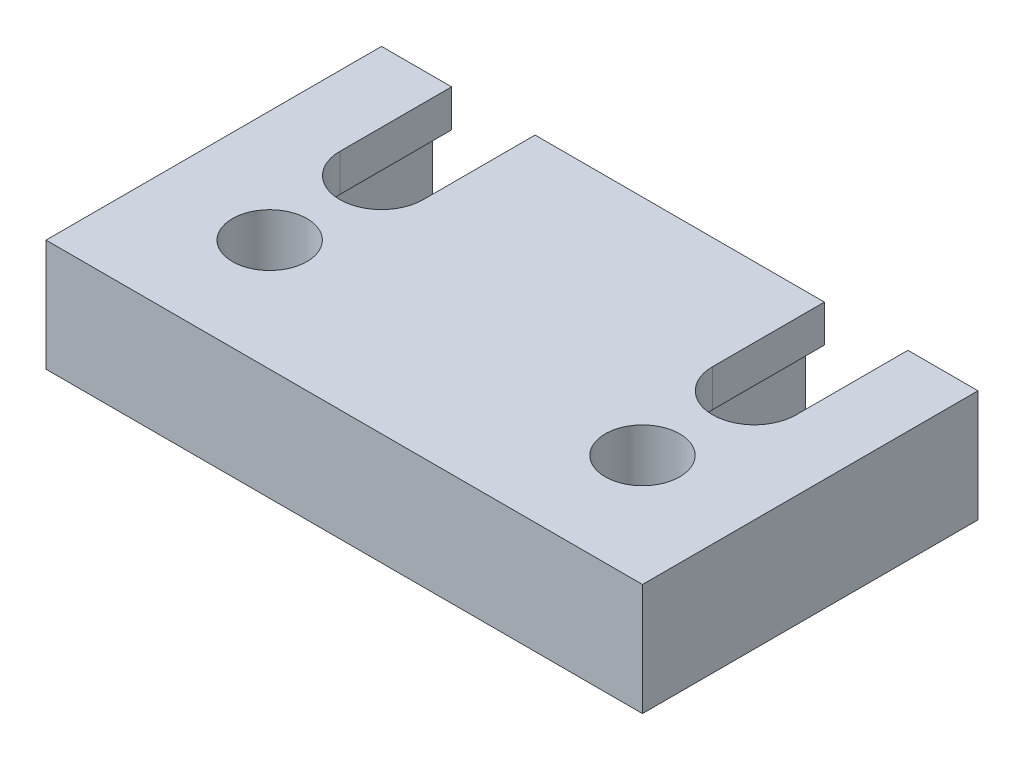
ISO-10303-21;
HEADER;
FILE_DESCRIPTION(('STEP AP214'),'2;1');
FILE_NAME('part.step','',(''),(''),'','','');
FILE_SCHEMA(('AUTOMOTIVE_DESIGN { 1 0 10303 214 1 1 1 1 }'));
ENDSEC;
DATA;
#1=APPLICATION_CONTEXT('core data for automotive mechanical design processes');
#2=APPLICATION_PROTOCOL_DEFINITION('international standard','automotive_design',2000,#1);
#3=PRODUCT_CONTEXT('',#1,'mechanical');
#4=PRODUCT('Part','Part','',(#3));
#5=PRODUCT_RELATED_PRODUCT_CATEGORY('part','',(#4));
#6=PRODUCT_DEFINITION_FORMATION('','',#4);
#7=PRODUCT_DEFINITION_CONTEXT('part definition',#1,'design');
#8=PRODUCT_DEFINITION('design','',#6,#7);
#9=PRODUCT_DEFINITION_SHAPE('','',#8);
#10=(LENGTH_UNIT() NAMED_UNIT(*) SI_UNIT(.MILLI.,.METRE.));
#11=(NAMED_UNIT(*) PLANE_ANGLE_UNIT() SI_UNIT($,.RADIAN.));
#12=(NAMED_UNIT(*) SI_UNIT($,.STERADIAN.) SOLID_ANGLE_UNIT());
#13=UNCERTAINTY_MEASURE_WITH_UNIT(LENGTH_MEASURE(1.E-05),#10,'distance_accuracy_value','');
#14=(GEOMETRIC_REPRESENTATION_CONTEXT(3) GLOBAL_UNCERTAINTY_ASSIGNED_CONTEXT((#13)) GLOBAL_UNIT_ASSIGNED_CONTEXT((#10,
#11,#12)) REPRESENTATION_CONTEXT('',''));
#15=CARTESIAN_POINT('',(0.,0.,0.));
#16=DIRECTION('',(0.,0.,1.));
#17=DIRECTION('',(1.,0.,0.));
#18=AXIS2_PLACEMENT_3D('',#15,#16,#17);
#19=CARTESIAN_POINT('',(0.,19.05,0.));
#20=DIRECTION('',(0.,-1.,0.));
#21=DIRECTION('',(0.,0.,-1.));
#22=AXIS2_PLACEMENT_3D('',#19,#20,#21);
#23=PLANE('',#22);
#24=CARTESIAN_POINT('',(88.9,19.05,-19.05));
#25=DIRECTION('',(0.,1.,0.));
#26=DIRECTION('',(0.,0.,1.));
#27=AXIS2_PLACEMENT_3D('',#24,#25,#26);
#28=CIRCLE('',#27,6.34999999999999);
#29=CARTESIAN_POINT('',(88.9,19.05,-12.7));
#30=VERTEX_POINT('',#29);
#31=EDGE_CURVE('E278',#30,#30,#28,.T.);
#32=ORIENTED_EDGE('',*,*,#31,.F.);
#33=EDGE_LOOP('',(#32));
#34=FACE_BOUND('',#33,.T.);
#35=CARTESIAN_POINT('',(25.4,19.05,-19.05));
#36=DIRECTION('',(0.,1.,0.));
#37=DIRECTION('',(0.,0.,1.));
#38=AXIS2_PLACEMENT_3D('',#35,#36,#37);
#39=CIRCLE('',#38,6.34999999999999);
#40=CARTESIAN_POINT('',(25.4,19.05,-12.7));
#41=VERTEX_POINT('',#40);
#42=EDGE_CURVE('E272',#41,#41,#39,.T.);
#43=ORIENTED_EDGE('',*,*,#42,.F.);
#44=EDGE_LOOP('',(#43));
#45=FACE_BOUND('',#44,.T.);
#46=DIRECTION('',(1.,0.,0.));
#47=VECTOR('',#46,1.);
#48=CARTESIAN_POINT('',(0.,19.05,-57.15));
#49=LINE('',#48,#47);
#50=CARTESIAN_POINT('',(6.34999999999999,19.05,-57.15));
#51=VERTEX_POINT('',#50);
#52=CARTESIAN_POINT('',(18.288,19.05,-57.15));
#53=VERTEX_POINT('',#52);
#54=EDGE_CURVE('E333',#51,#53,#49,.T.);
#55=ORIENTED_EDGE('',*,*,#54,.F.);
#56=DIRECTION('',(0.,0.,-1.));
#57=VECTOR('',#56,1.);
#58=CARTESIAN_POINT('',(6.35,19.05,0.));
#59=LINE('',#58,#57);
#60=CARTESIAN_POINT('',(6.35,19.05,0.));
#61=VERTEX_POINT('',#60);
#62=EDGE_CURVE('E211',#61,#51,#59,.T.);
#63=ORIENTED_EDGE('',*,*,#62,.F.);
#64=DIRECTION('',(1.,0.,0.));
#65=VECTOR('',#64,1.);
#66=CARTESIAN_POINT('',(0.,19.05,0.));
#67=LINE('',#66,#65);
#68=CARTESIAN_POINT('',(107.95,19.05,0.));
#69=VERTEX_POINT('',#68);
#70=EDGE_CURVE('E310',#61,#69,#67,.T.);
#71=ORIENTED_EDGE('',*,*,#70,.T.);
#72=DIRECTION('',(0.,0.,1.));
#73=VECTOR('',#72,1.);
#74=CARTESIAN_POINT('',(107.95,19.05,0.));
#75=LINE('',#74,#73);
#76=CARTESIAN_POINT('',(107.95,19.05,-57.15));
#77=VERTEX_POINT('',#76);
#78=EDGE_CURVE('E206',#77,#69,#75,.T.);
#79=ORIENTED_EDGE('',*,*,#78,.F.);
#80=CARTESIAN_POINT('',(96.012,19.05,-57.15));
#81=VERTEX_POINT('',#80);
#82=EDGE_CURVE('E68',#81,#77,#49,.T.);
#83=ORIENTED_EDGE('',*,*,#82,.F.);
#84=DIRECTION('',(0.,0.,-1.));
#85=VECTOR('',#84,1.);
#86=CARTESIAN_POINT('',(96.012,19.05,-63.5));
#87=LINE('',#86,#85);
#88=CARTESIAN_POINT('',(96.012,19.05,-38.1));
#89=VERTEX_POINT('',#88);
#90=EDGE_CURVE('E300',#89,#81,#87,.T.);
#91=ORIENTED_EDGE('',*,*,#90,.F.);
#92=CARTESIAN_POINT('',(88.9,19.05,-38.1));
#93=DIRECTION('',(0.,1.,0.));
#94=DIRECTION('',(0.,0.,-1.));
#95=AXIS2_PLACEMENT_3D('',#92,#93,#94);
#96=CIRCLE('',#95,7.11200000000001);
#97=CARTESIAN_POINT('',(81.788,19.05,-38.1));
#98=VERTEX_POINT('',#97);
#99=EDGE_CURVE('E297',#98,#89,#96,.T.);
#100=ORIENTED_EDGE('',*,*,#99,.F.);
#101=DIRECTION('',(0.,0.,1.));
#102=VECTOR('',#101,1.);
#103=CARTESIAN_POINT('',(81.788,19.05,-63.5));
#104=LINE('',#103,#102);
#105=CARTESIAN_POINT('',(81.788,19.05,-57.15));
#106=VERTEX_POINT('',#105);
#107=EDGE_CURVE('E295',#106,#98,#104,.T.);
#108=ORIENTED_EDGE('',*,*,#107,.F.);
#109=CARTESIAN_POINT('',(32.512,19.05,-57.15));
#110=VERTEX_POINT('',#109);
#111=EDGE_CURVE('E334',#110,#106,#49,.T.);
#112=ORIENTED_EDGE('',*,*,#111,.F.);
#113=DIRECTION('',(0.,0.,-1.));
#114=VECTOR('',#113,1.);
#115=CARTESIAN_POINT('',(32.512,19.05,-63.5));
#116=LINE('',#115,#114);
#117=CARTESIAN_POINT('',(32.512,19.05,-38.1));
#118=VERTEX_POINT('',#117);
#119=EDGE_CURVE('E286',#118,#110,#116,.T.);
#120=ORIENTED_EDGE('',*,*,#119,.F.);
#121=CARTESIAN_POINT('',(25.4,19.05,-38.1));
#122=DIRECTION('',(0.,1.,0.));
#123=DIRECTION('',(0.,0.,1.));
#124=AXIS2_PLACEMENT_3D('',#121,#122,#123);
#125=CIRCLE('',#124,7.11200000000002);
#126=CARTESIAN_POINT('',(18.288,19.05,-38.1));
#127=VERTEX_POINT('',#126);
#128=EDGE_CURVE('E283',#127,#118,#125,.T.);
#129=ORIENTED_EDGE('',*,*,#128,.F.);
#130=DIRECTION('',(0.,0.,1.));
#131=VECTOR('',#130,1.);
#132=CARTESIAN_POINT('',(18.288,19.05,-63.5));
#133=LINE('',#132,#131);
#134=EDGE_CURVE('E281',#53,#127,#133,.T.);
#135=ORIENTED_EDGE('',*,*,#134,.F.);
#136=EDGE_LOOP('',(#55,#63,#71,#79,#83,#91,#100,#108,#112,#120,#129,#135));
#137=FACE_BOUND('',#136,.T.);
#138=ADVANCED_FACE('F45',(#34,#45,#137),#23,.F.);
#139=CARTESIAN_POINT('',(0.,0.,0.));
#140=DIRECTION('',(0.,-1.,0.));
#141=DIRECTION('',(0.,0.,-1.));
#142=AXIS2_PLACEMENT_3D('',#139,#140,#141);
#143=PLANE('',#142);
#144=CARTESIAN_POINT('',(88.9,0.,-19.05));
#145=DIRECTION('',(0.,1.,0.));
#146=DIRECTION('',(0.,0.,1.));
#147=AXIS2_PLACEMENT_3D('',#144,#145,#146);
#148=CIRCLE('',#147,6.34999999999998);
#149=CARTESIAN_POINT('',(88.9,0.,-12.7));
#150=VERTEX_POINT('',#149);
#151=EDGE_CURVE('E275',#150,#150,#148,.T.);
#152=ORIENTED_EDGE('',*,*,#151,.T.);
#153=EDGE_LOOP('',(#152));
#154=FACE_BOUND('',#153,.T.);
#155=CARTESIAN_POINT('',(25.4,0.,-19.05));
#156=DIRECTION('',(0.,1.,0.));
#157=DIRECTION('',(0.,0.,1.));
#158=AXIS2_PLACEMENT_3D('',#155,#156,#157);
#159=CIRCLE('',#158,6.34999999999999);
#160=CARTESIAN_POINT('',(25.4,0.,-12.7));
#161=VERTEX_POINT('',#160);
#162=EDGE_CURVE('E269',#161,#161,#159,.T.);
#163=ORIENTED_EDGE('',*,*,#162,.T.);
#164=EDGE_LOOP('',(#163));
#165=FACE_BOUND('',#164,.T.);
#166=DIRECTION('',(0.,0.,-1.));
#167=VECTOR('',#166,1.);
#168=CARTESIAN_POINT('',(6.35,0.,0.));
#169=LINE('',#168,#167);
#170=CARTESIAN_POINT('',(6.35,0.,0.));
#171=VERTEX_POINT('',#170);
#172=CARTESIAN_POINT('',(6.35,0.,-57.15));
#173=VERTEX_POINT('',#172);
#174=EDGE_CURVE('E338',#171,#173,#169,.T.);
#175=ORIENTED_EDGE('',*,*,#174,.T.);
#176=DIRECTION('',(1.,0.,0.));
#177=VECTOR('',#176,1.);
#178=CARTESIAN_POINT('',(0.,0.,-57.15));
#179=LINE('',#178,#177);
#180=CARTESIAN_POINT('',(15.0749,0.,-57.15));
#181=VERTEX_POINT('',#180);
#182=EDGE_CURVE('E200',#173,#181,#179,.T.);
#183=ORIENTED_EDGE('',*,*,#182,.T.);
#184=DIRECTION('',(0.,0.,-1.));
#185=VECTOR('',#184,1.);
#186=CARTESIAN_POINT('',(15.0749,0.,-63.5));
#187=LINE('',#186,#185);
#188=CARTESIAN_POINT('',(15.0749,0.,-38.1));
#189=VERTEX_POINT('',#188);
#190=EDGE_CURVE('E246',#189,#181,#187,.T.);
#191=ORIENTED_EDGE('',*,*,#190,.F.);
#192=CARTESIAN_POINT('',(25.4,0.,-38.1));
#193=DIRECTION('',(0.,-1.,0.));
#194=DIRECTION('',(0.,0.,-1.));
#195=AXIS2_PLACEMENT_3D('',#192,#193,#194);
#196=CIRCLE('',#195,10.3251);
#197=CARTESIAN_POINT('',(35.7251,0.,-38.1));
#198=VERTEX_POINT('',#197);
#199=EDGE_CURVE('E254',#198,#189,#196,.T.);
#200=ORIENTED_EDGE('',*,*,#199,.F.);
#201=DIRECTION('',(0.,0.,1.));
#202=VECTOR('',#201,1.);
#203=CARTESIAN_POINT('',(35.7251,0.,-38.1));
#204=LINE('',#203,#202);
#205=CARTESIAN_POINT('',(35.7251,0.,-57.15));
#206=VERTEX_POINT('',#205);
#207=EDGE_CURVE('E242',#206,#198,#204,.T.);
#208=ORIENTED_EDGE('',*,*,#207,.F.);
#209=CARTESIAN_POINT('',(78.5749,0.,-57.15));
#210=VERTEX_POINT('',#209);
#211=EDGE_CURVE('E201',#206,#210,#179,.T.);
#212=ORIENTED_EDGE('',*,*,#211,.T.);
#213=DIRECTION('',(0.,0.,-1.));
#214=VECTOR('',#213,1.);
#215=CARTESIAN_POINT('',(78.5749,0.,-63.5));
#216=LINE('',#215,#214);
#217=CARTESIAN_POINT('',(78.5749,0.,-38.1));
#218=VERTEX_POINT('',#217);
#219=EDGE_CURVE('E227',#218,#210,#216,.T.);
#220=ORIENTED_EDGE('',*,*,#219,.F.);
#221=CARTESIAN_POINT('',(88.9,0.,-38.1));
#222=DIRECTION('',(0.,-1.,0.));
#223=DIRECTION('',(0.,0.,-1.));
#224=AXIS2_PLACEMENT_3D('',#221,#222,#223);
#225=CIRCLE('',#224,10.3251);
#226=CARTESIAN_POINT('',(99.2251000000001,0.,-38.1));
#227=VERTEX_POINT('',#226);
#228=EDGE_CURVE('E216',#227,#218,#225,.T.);
#229=ORIENTED_EDGE('',*,*,#228,.F.);
#230=DIRECTION('',(0.,0.,1.));
#231=VECTOR('',#230,1.);
#232=CARTESIAN_POINT('',(99.2251000000001,0.,-38.1));
#233=LINE('',#232,#231);
#234=CARTESIAN_POINT('',(99.2251000000001,0.,-57.15));
#235=VERTEX_POINT('',#234);
#236=EDGE_CURVE('E197',#235,#227,#233,.T.);
#237=ORIENTED_EDGE('',*,*,#236,.F.);
#238=CARTESIAN_POINT('',(107.95,0.,-57.15));
#239=VERTEX_POINT('',#238);
#240=EDGE_CURVE('E182',#235,#239,#179,.T.);
#241=ORIENTED_EDGE('',*,*,#240,.T.);
#242=DIRECTION('',(0.,0.,1.));
#243=VECTOR('',#242,1.);
#244=CARTESIAN_POINT('',(107.95,0.,0.));
#245=LINE('',#244,#243);
#246=CARTESIAN_POINT('',(107.95,0.,0.));
#247=VERTEX_POINT('',#246);
#248=EDGE_CURVE('E194',#239,#247,#245,.T.);
#249=ORIENTED_EDGE('',*,*,#248,.T.);
#250=DIRECTION('',(1.,0.,0.));
#251=VECTOR('',#250,1.);
#252=CARTESIAN_POINT('',(0.,0.,0.));
#253=LINE('',#252,#251);
#254=EDGE_CURVE('E309',#171,#247,#253,.T.);
#255=ORIENTED_EDGE('',*,*,#254,.F.);
#256=EDGE_LOOP('',(#175,#183,#191,#200,#208,#212,#220,#229,#237,#241,#249,#255));
#257=FACE_BOUND('',#256,.T.);
#258=ADVANCED_FACE('F192',(#154,#165,#257),#143,.T.);
#259=CARTESIAN_POINT('',(81.788,19.05,-63.5));
#260=DIRECTION('',(1.,0.,0.));
#261=DIRECTION('',(0.,0.,-1.));
#262=AXIS2_PLACEMENT_3D('',#259,#260,#261);
#263=PLANE('',#262);
#264=DIRECTION('',(0.,0.,-1.));
#265=VECTOR('',#264,1.);
#266=CARTESIAN_POINT('',(81.788,12.7,-63.5));
#267=LINE('',#266,#265);
#268=CARTESIAN_POINT('',(81.788,12.7,-38.1));
#269=VERTEX_POINT('',#268);
#270=CARTESIAN_POINT('',(81.788,12.7,-57.15));
#271=VERTEX_POINT('',#270);
#272=EDGE_CURVE('E239',#269,#271,#267,.T.);
#273=ORIENTED_EDGE('',*,*,#272,.T.);
#274=DIRECTION('',(0.,1.,0.));
#275=VECTOR('',#274,1.);
#276=CARTESIAN_POINT('',(81.788,19.05,-57.15));
#277=LINE('',#276,#275);
#278=EDGE_CURVE('E60',#271,#106,#277,.T.);
#279=ORIENTED_EDGE('',*,*,#278,.T.);
#280=ORIENTED_EDGE('',*,*,#107,.T.);
#281=DIRECTION('',(0.,-1.,0.));
#282=VECTOR('',#281,1.);
#283=CARTESIAN_POINT('',(81.788,19.05,-38.1));
#284=LINE('',#283,#282);
#285=EDGE_CURVE('E306',#98,#269,#284,.T.);
#286=ORIENTED_EDGE('',*,*,#285,.T.);
#287=EDGE_LOOP('',(#273,#279,#280,#286));
#288=FACE_BOUND('',#287,.T.);
#289=ADVANCED_FACE('F380',(#288),#263,.T.);
#290=CARTESIAN_POINT('',(96.012,19.05,-63.5));
#291=DIRECTION('',(-1.,0.,0.));
#292=DIRECTION('',(0.,0.,1.));
#293=AXIS2_PLACEMENT_3D('',#290,#291,#292);
#294=PLANE('',#293);
#295=ORIENTED_EDGE('',*,*,#90,.T.);
#296=DIRECTION('',(0.,-1.,0.));
#297=VECTOR('',#296,1.);
#298=CARTESIAN_POINT('',(96.012,19.05,-57.15));
#299=LINE('',#298,#297);
#300=CARTESIAN_POINT('',(96.012,12.7,-57.15));
#301=VERTEX_POINT('',#300);
#302=EDGE_CURVE('E198',#81,#301,#299,.T.);
#303=ORIENTED_EDGE('',*,*,#302,.T.);
#304=DIRECTION('',(0.,0.,1.));
#305=VECTOR('',#304,1.);
#306=CARTESIAN_POINT('',(96.012,12.7,-63.5));
#307=LINE('',#306,#305);
#308=CARTESIAN_POINT('',(96.012,12.7,-38.1));
#309=VERTEX_POINT('',#308);
#310=EDGE_CURVE('E53',#301,#309,#307,.T.);
#311=ORIENTED_EDGE('',*,*,#310,.T.);
#312=DIRECTION('',(0.,-1.,0.));
#313=VECTOR('',#312,1.);
#314=CARTESIAN_POINT('',(96.012,19.05,-38.1));
#315=LINE('',#314,#313);
#316=EDGE_CURVE('E303',#89,#309,#315,.T.);
#317=ORIENTED_EDGE('',*,*,#316,.F.);
#318=EDGE_LOOP('',(#295,#303,#311,#317));
#319=FACE_BOUND('',#318,.T.);
#320=ADVANCED_FACE('F319',(#319),#294,.T.);
#321=CARTESIAN_POINT('',(18.288,19.05,-63.5));
#322=DIRECTION('',(1.,0.,0.));
#323=DIRECTION('',(0.,0.,-1.));
#324=AXIS2_PLACEMENT_3D('',#321,#322,#323);
#325=PLANE('',#324);
#326=DIRECTION('',(0.,0.,-1.));
#327=VECTOR('',#326,1.);
#328=CARTESIAN_POINT('',(18.288,12.7,-63.5));
#329=LINE('',#328,#327);
#330=CARTESIAN_POINT('',(18.288,12.7,-38.1));
#331=VERTEX_POINT('',#330);
#332=CARTESIAN_POINT('',(18.288,12.7,-57.15));
#333=VERTEX_POINT('',#332);
#334=EDGE_CURVE('E266',#331,#333,#329,.T.);
#335=ORIENTED_EDGE('',*,*,#334,.T.);
#336=DIRECTION('',(0.,1.,0.));
#337=VECTOR('',#336,1.);
#338=CARTESIAN_POINT('',(18.288,19.05,-57.15));
#339=LINE('',#338,#337);
#340=EDGE_CURVE('E349',#333,#53,#339,.T.);
#341=ORIENTED_EDGE('',*,*,#340,.T.);
#342=ORIENTED_EDGE('',*,*,#134,.T.);
#343=DIRECTION('',(0.,-1.,0.));
#344=VECTOR('',#343,1.);
#345=CARTESIAN_POINT('',(18.288,19.05,-38.1));
#346=LINE('',#345,#344);
#347=EDGE_CURVE('E292',#127,#331,#346,.T.);
#348=ORIENTED_EDGE('',*,*,#347,.T.);
#349=EDGE_LOOP('',(#335,#341,#342,#348));
#350=FACE_BOUND('',#349,.T.);
#351=ADVANCED_FACE('F390',(#350),#325,.T.);
#352=CARTESIAN_POINT('',(32.512,19.05,-63.5));
#353=DIRECTION('',(-1.,0.,0.));
#354=DIRECTION('',(0.,0.,1.));
#355=AXIS2_PLACEMENT_3D('',#352,#353,#354);
#356=PLANE('',#355);
#357=ORIENTED_EDGE('',*,*,#119,.T.);
#358=DIRECTION('',(0.,-1.,0.));
#359=VECTOR('',#358,1.);
#360=CARTESIAN_POINT('',(32.512,19.05,-57.15));
#361=LINE('',#360,#359);
#362=CARTESIAN_POINT('',(32.512,12.7,-57.15));
#363=VERTEX_POINT('',#362);
#364=EDGE_CURVE('E341',#110,#363,#361,.T.);
#365=ORIENTED_EDGE('',*,*,#364,.T.);
#366=DIRECTION('',(0.,0.,1.));
#367=VECTOR('',#366,1.);
#368=CARTESIAN_POINT('',(32.512,12.7,-63.5));
#369=LINE('',#368,#367);
#370=CARTESIAN_POINT('',(32.512,12.7,-38.1));
#371=VERTEX_POINT('',#370);
#372=EDGE_CURVE('E313',#363,#371,#369,.T.);
#373=ORIENTED_EDGE('',*,*,#372,.T.);
#374=DIRECTION('',(0.,-1.,0.));
#375=VECTOR('',#374,1.);
#376=CARTESIAN_POINT('',(32.512,19.05,-38.1));
#377=LINE('',#376,#375);
#378=EDGE_CURVE('E289',#118,#371,#377,.T.);
#379=ORIENTED_EDGE('',*,*,#378,.F.);
#380=EDGE_LOOP('',(#357,#365,#373,#379));
#381=FACE_BOUND('',#380,.T.);
#382=ADVANCED_FACE('F393',(#381),#356,.T.);
#383=CARTESIAN_POINT('',(15.0749,12.7,-63.5));
#384=DIRECTION('',(-1.,0.,0.));
#385=DIRECTION('',(0.,0.,1.));
#386=AXIS2_PLACEMENT_3D('',#383,#384,#385);
#387=PLANE('',#386);
#388=DIRECTION('',(0.,-1.,0.));
#389=VECTOR('',#388,1.);
#390=CARTESIAN_POINT('',(15.0749,12.7,-57.15));
#391=LINE('',#390,#389);
#392=CARTESIAN_POINT('',(15.0749,12.7,-57.15));
#393=VERTEX_POINT('',#392);
#394=EDGE_CURVE('E352',#393,#181,#391,.T.);
#395=ORIENTED_EDGE('',*,*,#394,.F.);
#396=DIRECTION('',(0.,0.,-1.));
#397=VECTOR('',#396,1.);
#398=CARTESIAN_POINT('',(15.0749,12.7,-63.5));
#399=LINE('',#398,#397);
#400=CARTESIAN_POINT('',(15.0749,12.7,-38.1));
#401=VERTEX_POINT('',#400);
#402=EDGE_CURVE('E249',#401,#393,#399,.T.);
#403=ORIENTED_EDGE('',*,*,#402,.F.);
#404=DIRECTION('',(0.,-1.,0.));
#405=VECTOR('',#404,1.);
#406=CARTESIAN_POINT('',(15.0749,12.7,-38.1));
#407=LINE('',#406,#405);
#408=EDGE_CURVE('E259',#401,#189,#407,.T.);
#409=ORIENTED_EDGE('',*,*,#408,.T.);
#410=ORIENTED_EDGE('',*,*,#190,.T.);
#411=EDGE_LOOP('',(#395,#403,#409,#410));
#412=FACE_BOUND('',#411,.T.);
#413=ADVANCED_FACE('F400',(#412),#387,.F.);
#414=CARTESIAN_POINT('',(35.7251,12.7,-38.1));
#415=DIRECTION('',(1.,0.,0.));
#416=DIRECTION('',(0.,0.,-1.));
#417=AXIS2_PLACEMENT_3D('',#414,#415,#416);
#418=PLANE('',#417);
#419=DIRECTION('',(0.,1.,0.));
#420=VECTOR('',#419,1.);
#421=CARTESIAN_POINT('',(35.7251,12.7,-57.15));
#422=LINE('',#421,#420);
#423=CARTESIAN_POINT('',(35.7251,12.7,-57.15));
#424=VERTEX_POINT('',#423);
#425=EDGE_CURVE('E339',#206,#424,#422,.T.);
#426=ORIENTED_EDGE('',*,*,#425,.F.);
#427=ORIENTED_EDGE('',*,*,#207,.T.);
#428=DIRECTION('',(0.,-1.,0.));
#429=VECTOR('',#428,1.);
#430=CARTESIAN_POINT('',(35.7251,12.7,-38.1));
#431=LINE('',#430,#429);
#432=CARTESIAN_POINT('',(35.7251,12.7,-38.1));
#433=VERTEX_POINT('',#432);
#434=EDGE_CURVE('E252',#433,#198,#431,.T.);
#435=ORIENTED_EDGE('',*,*,#434,.F.);
#436=DIRECTION('',(0.,0.,1.));
#437=VECTOR('',#436,1.);
#438=CARTESIAN_POINT('',(35.7251,12.7,-38.1));
#439=LINE('',#438,#437);
#440=EDGE_CURVE('E243',#424,#433,#439,.T.);
#441=ORIENTED_EDGE('',*,*,#440,.F.);
#442=EDGE_LOOP('',(#426,#427,#435,#441));
#443=FACE_BOUND('',#442,.T.);
#444=ADVANCED_FACE('F410',(#443),#418,.F.);
#445=CARTESIAN_POINT('',(25.4,12.7,-63.5));
#446=DIRECTION('',(0.,-1.,0.));
#447=DIRECTION('',(0.,0.,-1.));
#448=AXIS2_PLACEMENT_3D('',#445,#446,#447);
#449=PLANE('',#448);
#450=ORIENTED_EDGE('',*,*,#402,.T.);
#451=DIRECTION('',(1.,0.,0.));
#452=VECTOR('',#451,1.);
#453=CARTESIAN_POINT('',(25.4,12.7,-57.15));
#454=LINE('',#453,#452);
#455=EDGE_CURVE('E356',#393,#333,#454,.T.);
#456=ORIENTED_EDGE('',*,*,#455,.T.);
#457=ORIENTED_EDGE('',*,*,#334,.F.);
#458=CARTESIAN_POINT('',(25.4,12.7,-38.1));
#459=DIRECTION('',(0.,-1.,0.));
#460=DIRECTION('',(0.,0.,-1.));
#461=AXIS2_PLACEMENT_3D('',#458,#459,#460);
#462=CIRCLE('',#461,7.11200000000002);
#463=EDGE_CURVE('E261',#371,#331,#462,.T.);
#464=ORIENTED_EDGE('',*,*,#463,.F.);
#465=ORIENTED_EDGE('',*,*,#372,.F.);
#466=EDGE_CURVE('E459',#363,#424,#454,.T.);
#467=ORIENTED_EDGE('',*,*,#466,.T.);
#468=ORIENTED_EDGE('',*,*,#440,.T.);
#469=CARTESIAN_POINT('',(25.4,12.7,-38.1));
#470=DIRECTION('',(0.,-1.,0.));
#471=DIRECTION('',(0.,0.,-1.));
#472=AXIS2_PLACEMENT_3D('',#469,#470,#471);
#473=CIRCLE('',#472,10.3251);
#474=EDGE_CURVE('E245',#433,#401,#473,.T.);
#475=ORIENTED_EDGE('',*,*,#474,.T.);
#476=EDGE_LOOP('',(#450,#456,#457,#464,#465,#467,#468,#475));
#477=FACE_BOUND('',#476,.T.);
#478=ADVANCED_FACE('F413',(#477),#449,.T.);
#479=CARTESIAN_POINT('',(99.2251000000001,12.7,-38.1));
#480=DIRECTION('',(1.,0.,0.));
#481=DIRECTION('',(0.,0.,-1.));
#482=AXIS2_PLACEMENT_3D('',#479,#480,#481);
#483=PLANE('',#482);
#484=DIRECTION('',(0.,1.,0.));
#485=VECTOR('',#484,1.);
#486=CARTESIAN_POINT('',(99.2251000000001,12.7,-57.15));
#487=LINE('',#486,#485);
#488=CARTESIAN_POINT('',(99.2251000000001,12.7,-57.15));
#489=VERTEX_POINT('',#488);
#490=EDGE_CURVE('E469',#235,#489,#487,.T.);
#491=ORIENTED_EDGE('',*,*,#490,.F.);
#492=ORIENTED_EDGE('',*,*,#236,.T.);
#493=DIRECTION('',(0.,-1.,0.));
#494=VECTOR('',#493,1.);
#495=CARTESIAN_POINT('',(99.2251000000001,12.7,-38.1));
#496=LINE('',#495,#494);
#497=CARTESIAN_POINT('',(99.2251000000001,12.7,-38.1));
#498=VERTEX_POINT('',#497);
#499=EDGE_CURVE('E231',#498,#227,#496,.T.);
#500=ORIENTED_EDGE('',*,*,#499,.F.);
#501=DIRECTION('',(0.,0.,1.));
#502=VECTOR('',#501,1.);
#503=CARTESIAN_POINT('',(99.2251000000001,12.7,-38.1));
#504=LINE('',#503,#502);
#505=EDGE_CURVE('E223',#489,#498,#504,.T.);
#506=ORIENTED_EDGE('',*,*,#505,.F.);
#507=EDGE_LOOP('',(#491,#492,#500,#506));
#508=FACE_BOUND('',#507,.T.);
#509=ADVANCED_FACE('F424',(#508),#483,.F.);
#510=CARTESIAN_POINT('',(78.5749,12.7,-63.5));
#511=DIRECTION('',(-1.,0.,0.));
#512=DIRECTION('',(0.,0.,1.));
#513=AXIS2_PLACEMENT_3D('',#510,#511,#512);
#514=PLANE('',#513);
#515=DIRECTION('',(0.,-1.,0.));
#516=VECTOR('',#515,1.);
#517=CARTESIAN_POINT('',(78.5749,12.7,-57.15));
#518=LINE('',#517,#516);
#519=CARTESIAN_POINT('',(78.5749,12.7,-57.15));
#520=VERTEX_POINT('',#519);
#521=EDGE_CURVE('E335',#520,#210,#518,.T.);
#522=ORIENTED_EDGE('',*,*,#521,.F.);
#523=DIRECTION('',(0.,0.,-1.));
#524=VECTOR('',#523,1.);
#525=CARTESIAN_POINT('',(78.5749,12.7,-63.5));
#526=LINE('',#525,#524);
#527=CARTESIAN_POINT('',(78.5749,12.7,-38.1));
#528=VERTEX_POINT('',#527);
#529=EDGE_CURVE('E220',#528,#520,#526,.T.);
#530=ORIENTED_EDGE('',*,*,#529,.F.);
#531=DIRECTION('',(0.,-1.,0.));
#532=VECTOR('',#531,1.);
#533=CARTESIAN_POINT('',(78.5749,12.7,-38.1));
#534=LINE('',#533,#532);
#535=EDGE_CURVE('E225',#528,#218,#534,.T.);
#536=ORIENTED_EDGE('',*,*,#535,.T.);
#537=ORIENTED_EDGE('',*,*,#219,.T.);
#538=EDGE_LOOP('',(#522,#530,#536,#537));
#539=FACE_BOUND('',#538,.T.);
#540=ADVANCED_FACE('F430',(#539),#514,.F.);
#541=CARTESIAN_POINT('',(88.9,12.7,-38.1));
#542=DIRECTION('',(0.,-1.,0.));
#543=DIRECTION('',(0.,0.,-1.));
#544=AXIS2_PLACEMENT_3D('',#541,#542,#543);
#545=PLANE('',#544);
#546=ORIENTED_EDGE('',*,*,#529,.T.);
#547=DIRECTION('',(1.,0.,0.));
#548=VECTOR('',#547,1.);
#549=CARTESIAN_POINT('',(88.9,12.7,-57.15));
#550=LINE('',#549,#548);
#551=EDGE_CURVE('E331',#520,#271,#550,.T.);
#552=ORIENTED_EDGE('',*,*,#551,.T.);
#553=ORIENTED_EDGE('',*,*,#272,.F.);
#554=CARTESIAN_POINT('',(88.9,12.7,-38.1));
#555=DIRECTION('',(0.,-1.,0.));
#556=DIRECTION('',(0.,0.,-1.));
#557=AXIS2_PLACEMENT_3D('',#554,#555,#556);
#558=CIRCLE('',#557,7.11200000000001);
#559=EDGE_CURVE('E234',#309,#269,#558,.T.);
#560=ORIENTED_EDGE('',*,*,#559,.F.);
#561=ORIENTED_EDGE('',*,*,#310,.F.);
#562=EDGE_CURVE('E187',#301,#489,#550,.T.);
#563=ORIENTED_EDGE('',*,*,#562,.T.);
#564=ORIENTED_EDGE('',*,*,#505,.T.);
#565=CARTESIAN_POINT('',(88.9,12.7,-38.1));
#566=DIRECTION('',(0.,-1.,0.));
#567=DIRECTION('',(0.,0.,-1.));
#568=AXIS2_PLACEMENT_3D('',#565,#566,#567);
#569=CIRCLE('',#568,10.3251);
#570=EDGE_CURVE('E217',#498,#528,#569,.T.);
#571=ORIENTED_EDGE('',*,*,#570,.T.);
#572=EDGE_LOOP('',(#546,#552,#553,#560,#561,#563,#564,#571));
#573=FACE_BOUND('',#572,.T.);
#574=ADVANCED_FACE('F322',(#573),#545,.T.);
#575=CARTESIAN_POINT('',(107.95,-189.232616738492,15.9678186767664));
#576=DIRECTION('',(1.,0.,0.));
#577=DIRECTION('',(0.,0.,-1.));
#578=AXIS2_PLACEMENT_3D('',#575,#576,#577);
#579=PLANE('',#578);
#580=ORIENTED_EDGE('',*,*,#248,.F.);
#581=DIRECTION('',(0.,1.,0.));
#582=VECTOR('',#581,1.);
#583=CARTESIAN_POINT('',(107.95,-184.338503053244,-57.15));
#584=LINE('',#583,#582);
#585=EDGE_CURVE('E179',#239,#77,#584,.T.);
#586=ORIENTED_EDGE('',*,*,#585,.T.);
#587=ORIENTED_EDGE('',*,*,#78,.T.);
#588=DIRECTION('',(0.,-1.,0.));
#589=VECTOR('',#588,1.);
#590=CARTESIAN_POINT('',(107.95,19.05,0.));
#591=LINE('',#590,#589);
#592=EDGE_CURVE('E205',#69,#247,#591,.T.);
#593=ORIENTED_EDGE('',*,*,#592,.T.);
#594=EDGE_LOOP('',(#580,#586,#587,#593));
#595=FACE_BOUND('',#594,.T.);
#596=ADVANCED_FACE('F203',(#595),#579,.T.);
#597=CARTESIAN_POINT('',(6.35,-190.688881080427,-87.7035033731803));
#598=DIRECTION('',(-1.,0.,0.));
#599=DIRECTION('',(0.,0.,1.));
#600=AXIS2_PLACEMENT_3D('',#597,#598,#599);
#601=PLANE('',#600);
#602=ORIENTED_EDGE('',*,*,#62,.T.);
#603=DIRECTION('',(0.,-1.,0.));
#604=VECTOR('',#603,1.);
#605=CARTESIAN_POINT('',(6.35,-190.688881080427,-57.15));
#606=LINE('',#605,#604);
#607=EDGE_CURVE('E13',#51,#173,#606,.T.);
#608=ORIENTED_EDGE('',*,*,#607,.T.);
#609=ORIENTED_EDGE('',*,*,#174,.F.);
#610=DIRECTION('',(0.,1.,0.));
#611=VECTOR('',#610,1.);
#612=CARTESIAN_POINT('',(6.35,19.05,0.));
#613=LINE('',#612,#611);
#614=EDGE_CURVE('E207',#171,#61,#613,.T.);
#615=ORIENTED_EDGE('',*,*,#614,.T.);
#616=EDGE_LOOP('',(#602,#608,#609,#615));
#617=FACE_BOUND('',#616,.T.);
#618=ADVANCED_FACE('F362',(#617),#601,.T.);
#619=CARTESIAN_POINT('',(0.,19.05,0.));
#620=DIRECTION('',(0.,0.,-1.));
#621=DIRECTION('',(-1.,0.,0.));
#622=AXIS2_PLACEMENT_3D('',#619,#620,#621);
#623=PLANE('',#622);
#624=ORIENTED_EDGE('',*,*,#614,.F.);
#625=ORIENTED_EDGE('',*,*,#254,.T.);
#626=ORIENTED_EDGE('',*,*,#592,.F.);
#627=ORIENTED_EDGE('',*,*,#70,.F.);
#628=EDGE_LOOP('',(#624,#625,#626,#627));
#629=FACE_BOUND('',#628,.T.);
#630=ADVANCED_FACE('F47',(#629),#623,.F.);
#631=CARTESIAN_POINT('',(88.9,19.05,-38.1));
#632=DIRECTION('',(0.,-1.,0.));
#633=DIRECTION('',(0.,0.,-1.));
#634=AXIS2_PLACEMENT_3D('',#631,#632,#633);
#635=CYLINDRICAL_SURFACE('',#634,7.11200000000001);
#636=ORIENTED_EDGE('',*,*,#316,.T.);
#637=ORIENTED_EDGE('',*,*,#559,.T.);
#638=ORIENTED_EDGE('',*,*,#285,.F.);
#639=ORIENTED_EDGE('',*,*,#99,.T.);
#640=EDGE_LOOP('',(#636,#637,#638,#639));
#641=FACE_BOUND('',#640,.T.);
#642=ADVANCED_FACE('F325',(#641),#635,.F.);
#643=CARTESIAN_POINT('',(25.4,19.05,-38.1));
#644=DIRECTION('',(0.,-1.,0.));
#645=DIRECTION('',(0.,0.,-1.));
#646=AXIS2_PLACEMENT_3D('',#643,#644,#645);
#647=CYLINDRICAL_SURFACE('',#646,7.11200000000002);
#648=ORIENTED_EDGE('',*,*,#378,.T.);
#649=ORIENTED_EDGE('',*,*,#463,.T.);
#650=ORIENTED_EDGE('',*,*,#347,.F.);
#651=ORIENTED_EDGE('',*,*,#128,.T.);
#652=EDGE_LOOP('',(#648,#649,#650,#651));
#653=FACE_BOUND('',#652,.T.);
#654=ADVANCED_FACE('F371',(#653),#647,.F.);
#655=CARTESIAN_POINT('',(88.9,19.05,-19.05));
#656=DIRECTION('',(0.,1.,0.));
#657=DIRECTION('',(0.,0.,1.));
#658=AXIS2_PLACEMENT_3D('',#655,#656,#657);
#659=CYLINDRICAL_SURFACE('',#658,6.34999999999999);
#660=ORIENTED_EDGE('',*,*,#151,.F.);
#661=EDGE_LOOP('',(#660));
#662=FACE_BOUND('',#661,.T.);
#663=ORIENTED_EDGE('',*,*,#31,.T.);
#664=EDGE_LOOP('',(#663));
#665=FACE_BOUND('',#664,.T.);
#666=ADVANCED_FACE('F396',(#662,#665),#659,.F.);
#667=CARTESIAN_POINT('',(25.4,19.05,-19.05));
#668=DIRECTION('',(0.,1.,0.));
#669=DIRECTION('',(0.,0.,1.));
#670=AXIS2_PLACEMENT_3D('',#667,#668,#669);
#671=CYLINDRICAL_SURFACE('',#670,6.34999999999999);
#672=ORIENTED_EDGE('',*,*,#162,.F.);
#673=EDGE_LOOP('',(#672));
#674=FACE_BOUND('',#673,.T.);
#675=ORIENTED_EDGE('',*,*,#42,.T.);
#676=EDGE_LOOP('',(#675));
#677=FACE_BOUND('',#676,.T.);
#678=ADVANCED_FACE('F404',(#674,#677),#671,.F.);
#679=CARTESIAN_POINT('',(25.4,12.7,-38.1));
#680=DIRECTION('',(0.,-1.,0.));
#681=DIRECTION('',(0.,0.,-1.));
#682=AXIS2_PLACEMENT_3D('',#679,#680,#681);
#683=CYLINDRICAL_SURFACE('',#682,10.3251);
#684=ORIENTED_EDGE('',*,*,#199,.T.);
#685=ORIENTED_EDGE('',*,*,#408,.F.);
#686=ORIENTED_EDGE('',*,*,#474,.F.);
#687=ORIENTED_EDGE('',*,*,#434,.T.);
#688=EDGE_LOOP('',(#684,#685,#686,#687));
#689=FACE_BOUND('',#688,.T.);
#690=ADVANCED_FACE('F408',(#689),#683,.F.);
#691=CARTESIAN_POINT('',(88.9,12.7,-38.1));
#692=DIRECTION('',(0.,-1.,0.));
#693=DIRECTION('',(0.,0.,-1.));
#694=AXIS2_PLACEMENT_3D('',#691,#692,#693);
#695=CYLINDRICAL_SURFACE('',#694,10.3251);
#696=ORIENTED_EDGE('',*,*,#228,.T.);
#697=ORIENTED_EDGE('',*,*,#535,.F.);
#698=ORIENTED_EDGE('',*,*,#570,.F.);
#699=ORIENTED_EDGE('',*,*,#499,.T.);
#700=EDGE_LOOP('',(#696,#697,#698,#699));
#701=FACE_BOUND('',#700,.T.);
#702=ADVANCED_FACE('F417',(#701),#695,.F.);
#703=CARTESIAN_POINT('',(107.95,-184.338503053244,-57.15));
#704=DIRECTION('',(0.,0.,-1.));
#705=DIRECTION('',(-1.,0.,0.));
#706=AXIS2_PLACEMENT_3D('',#703,#704,#705);
#707=PLANE('',#706);
#708=ORIENTED_EDGE('',*,*,#607,.F.);
#709=ORIENTED_EDGE('',*,*,#54,.T.);
#710=ORIENTED_EDGE('',*,*,#340,.F.);
#711=ORIENTED_EDGE('',*,*,#455,.F.);
#712=ORIENTED_EDGE('',*,*,#394,.T.);
#713=ORIENTED_EDGE('',*,*,#182,.F.);
#714=EDGE_LOOP('',(#708,#709,#710,#711,#712,#713));
#715=FACE_BOUND('',#714,.T.);
#716=ADVANCED_FACE('F428',(#715),#707,.T.);
#717=ORIENTED_EDGE('',*,*,#302,.F.);
#718=ORIENTED_EDGE('',*,*,#82,.T.);
#719=ORIENTED_EDGE('',*,*,#585,.F.);
#720=ORIENTED_EDGE('',*,*,#240,.F.);
#721=ORIENTED_EDGE('',*,*,#490,.T.);
#722=ORIENTED_EDGE('',*,*,#562,.F.);
#723=EDGE_LOOP('',(#717,#718,#719,#720,#721,#722));
#724=FACE_BOUND('',#723,.T.);
#725=ADVANCED_FACE('F181',(#724),#707,.T.);
#726=ORIENTED_EDGE('',*,*,#466,.F.);
#727=ORIENTED_EDGE('',*,*,#364,.F.);
#728=ORIENTED_EDGE('',*,*,#111,.T.);
#729=ORIENTED_EDGE('',*,*,#278,.F.);
#730=ORIENTED_EDGE('',*,*,#551,.F.);
#731=ORIENTED_EDGE('',*,*,#521,.T.);
#732=ORIENTED_EDGE('',*,*,#211,.F.);
#733=ORIENTED_EDGE('',*,*,#425,.T.);
#734=EDGE_LOOP('',(#726,#727,#728,#729,#730,#731,#732,#733));
#735=FACE_BOUND('',#734,.T.);
#736=ADVANCED_FACE('F441',(#735),#707,.T.);
#737=CLOSED_SHELL('',(#138,#258,#289,#320,#351,#382,#413,#444,#478,#509,#540,#574,#596,#618,
#630,#642,#654,#666,#678,#690,#702,#716,#725,#736));
#738=MANIFOLD_SOLID_BREP('B2',#737);
#739=ADVANCED_BREP_SHAPE_REPRESENTATION('',(#18,#738),#14);
#740=SHAPE_DEFINITION_REPRESENTATION(#9,#739);
ENDSEC;
END-ISO-10303-21;
